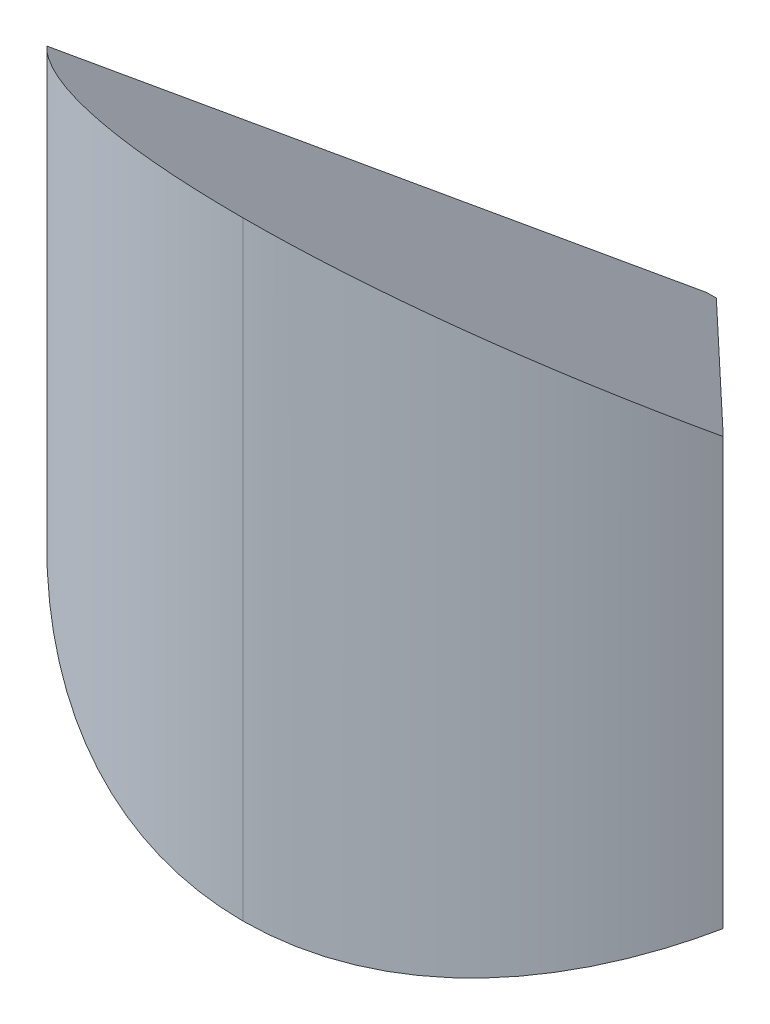
ISO-10303-21;
HEADER;
FILE_DESCRIPTION(('STEP AP214'),'2;1');
FILE_NAME('part.step','',(''),(''),'','','');
FILE_SCHEMA(('AUTOMOTIVE_DESIGN { 1 0 10303 214 1 1 1 1 }'));
ENDSEC;
DATA;
#1=APPLICATION_CONTEXT('core data for automotive mechanical design processes');
#2=APPLICATION_PROTOCOL_DEFINITION('international standard','automotive_design',2000,#1);
#3=PRODUCT_CONTEXT('',#1,'mechanical');
#4=PRODUCT('Part','Part','',(#3));
#5=PRODUCT_RELATED_PRODUCT_CATEGORY('part','',(#4));
#6=PRODUCT_DEFINITION_FORMATION('','',#4);
#7=PRODUCT_DEFINITION_CONTEXT('part definition',#1,'design');
#8=PRODUCT_DEFINITION('design','',#6,#7);
#9=PRODUCT_DEFINITION_SHAPE('','',#8);
#10=(LENGTH_UNIT() NAMED_UNIT(*) SI_UNIT(.MILLI.,.METRE.));
#11=(NAMED_UNIT(*) PLANE_ANGLE_UNIT() SI_UNIT($,.RADIAN.));
#12=(NAMED_UNIT(*) SI_UNIT($,.STERADIAN.) SOLID_ANGLE_UNIT());
#13=UNCERTAINTY_MEASURE_WITH_UNIT(LENGTH_MEASURE(1.E-05),#10,'distance_accuracy_value','');
#14=(GEOMETRIC_REPRESENTATION_CONTEXT(3) GLOBAL_UNCERTAINTY_ASSIGNED_CONTEXT((#13)) GLOBAL_UNIT_ASSIGNED_CONTEXT((#10,
#11,#12)) REPRESENTATION_CONTEXT('',''));
#15=CARTESIAN_POINT('',(0.,0.,0.));
#16=DIRECTION('',(0.,0.,1.));
#17=DIRECTION('',(1.,0.,0.));
#18=AXIS2_PLACEMENT_3D('',#15,#16,#17);
#19=CARTESIAN_POINT('',(4.000332533264,0.,1.681584956466));
#20=DIRECTION('',(-0.699663340513385,0.,-0.714472679632785));
#21=DIRECTION('',(-0.714472679632785,0.,0.699663340513385));
#22=AXIS2_PLACEMENT_3D('',#19,#20,#21);
#23=PLANE('',#22);
#24=DIRECTION('',(0.,1.,0.));
#25=VECTOR('',#24,1.);
#26=CARTESIAN_POINT('',(-14.28945359266,-9.000771663037,19.59226681027));
#27=LINE('',#26,#25);
#28=CARTESIAN_POINT('',(-14.28945359266,-9.000771663036,19.59226681027));
#29=VERTEX_POINT('',#28);
#30=CARTESIAN_POINT('',(-14.28945359266,9.000771663034,19.59226681027));
#31=VERTEX_POINT('',#30);
#32=EDGE_CURVE('E141',#29,#31,#27,.T.);
#33=ORIENTED_EDGE('',*,*,#32,.T.);
#34=DIRECTION('',(-0.651533593847997,0.410393936408799,0.638028834024297));
#35=VECTOR('',#34,1.);
#36=CARTESIAN_POINT('',(-0.2042332757092,0.1286443228024,5.799));
#37=LINE('',#36,#35);
#38=CARTESIAN_POINT('',(-0.2042332757092,0.1286443228024,5.799));
#39=VERTEX_POINT('',#38);
#40=EDGE_CURVE('E11',#39,#31,#37,.T.);
#41=ORIENTED_EDGE('',*,*,#40,.F.);
#42=DIRECTION('',(-1.546527368463E-12,1.,1.222032786687E-12));
#43=VECTOR('',#42,1.);
#44=CARTESIAN_POINT('',(-0.2042332757088,-0.1286443228045,5.799));
#45=LINE('',#44,#43);
#46=CARTESIAN_POINT('',(-0.2042332757088,-0.1286443228045,5.799));
#47=VERTEX_POINT('',#46);
#48=EDGE_CURVE('E46',#47,#39,#45,.T.);
#49=ORIENTED_EDGE('',*,*,#48,.F.);
#50=DIRECTION('',(0.651533593847997,0.410393936408799,-0.638028834024297));
#51=VECTOR('',#50,1.);
#52=CARTESIAN_POINT('',(-14.28945359266,-9.000771663037,19.59226681027));
#53=LINE('',#52,#51);
#54=EDGE_CURVE('E87',#29,#47,#53,.T.);
#55=ORIENTED_EDGE('',*,*,#54,.F.);
#56=EDGE_LOOP('',(#33,#41,#49,#55));
#57=FACE_BOUND('',#56,.T.);
#58=ADVANCED_FACE('F17',(#57),#23,.T.);
#59=CARTESIAN_POINT('',(-14.28945359266,0.1286443228029,5.799));
#60=DIRECTION('',(0.,-0.841039012964392,0.540974471367995));
#61=DIRECTION('',(-1.,0.,0.));
#62=AXIS2_PLACEMENT_3D('',#59,#60,#61);
#63=PLANE('',#62);
#64=DIRECTION('',(0.651533593847997,0.410393936408799,0.638028834024297));
#65=VECTOR('',#64,1.);
#66=CARTESIAN_POINT('',(0.2042332757092,0.1286443228024,5.799));
#67=LINE('',#66,#65);
#68=CARTESIAN_POINT('',(0.2042332757092,0.1286443228024,5.799));
#69=VERTEX_POINT('',#68);
#70=CARTESIAN_POINT('',(14.28945359266,9.000771663034,19.59226681027));
#71=VERTEX_POINT('',#70);
#72=EDGE_CURVE('E98',#69,#71,#67,.T.);
#73=ORIENTED_EDGE('',*,*,#72,.F.);
#74=DIRECTION('',(1.,0.,0.));
#75=VECTOR('',#74,1.);
#76=CARTESIAN_POINT('',(-0.2042332757092,0.1286443228024,5.799));
#77=LINE('',#76,#75);
#78=EDGE_CURVE('E28',#39,#69,#77,.T.);
#79=ORIENTED_EDGE('',*,*,#78,.F.);
#80=ORIENTED_EDGE('',*,*,#40,.T.);
#81=CARTESIAN_POINT('',(0.,12.86443228029,25.599));
#82=CARTESIAN_POINT('',(-0.334926275390209,12.8644397950071,25.5990199729841));
#83=CARTESIAN_POINT('',(-0.66984371311759,12.8589423454734,25.5905876807877));
#84=CARTESIAN_POINT('',(-1.34002546628665,12.8370597656007,25.5568857359147));
#85=CARTESIAN_POINT('',(-1.67528425954222,12.8206245456806,25.531538620242));
#86=CARTESIAN_POINT('',(-2.34528439253453,12.7768686704422,25.4638863211853));
#87=CARTESIAN_POINT('',(-2.68001217854618,12.7494872166826,25.4214864137275));
#88=CARTESIAN_POINT('',(-3.34808183652063,12.6838517491839,25.3196809773961));
#89=CARTESIAN_POINT('',(-3.68139985536102,12.6455269425867,25.2601647036633));
#90=CARTESIAN_POINT('',(-4.34577008420802,12.5580137801531,25.1241154132113));
#91=CARTESIAN_POINT('',(-4.6767860312731,12.5087453693679,25.0474569682556));
#92=CARTESIAN_POINT('',(-5.33566609987719,12.399354626408,24.8771593384552));
#93=CARTESIAN_POINT('',(-5.66347970509569,12.3391438126345,24.7833816956824));
#94=CARTESIAN_POINT('',(-6.31506165080029,12.2078746128825,24.5789282962459));
#95=CARTESIAN_POINT('',(-6.63876362247683,12.1367201736046,24.4681029083021));
#96=CARTESIAN_POINT('',(-7.28123443666715,11.9835776011918,24.2296793028669));
#97=CARTESIAN_POINT('',(-7.59991985485228,11.9014868329152,24.101922253007));
#98=CARTESIAN_POINT('',(-8.20107294436106,11.7348688212569,23.8429073178971));
#99=CARTESIAN_POINT('',(-8.48430246699901,11.6511545778792,23.7128897329706));
#100=CARTESIAN_POINT('',(-9.04770863577996,11.4742681888201,23.4382550648111));
#101=CARTESIAN_POINT('',(-9.32772686275894,11.3809473996145,23.2934088135945));
#102=CARTESIAN_POINT('',(-9.8838654818281,11.184854970526,22.9889859484772));
#103=CARTESIAN_POINT('',(-10.1598087260763,11.0819366439398,22.8291804825384));
#104=CARTESIAN_POINT('',(-10.7069261688309,10.866644796674,22.4947541219221));
#105=CARTESIAN_POINT('',(-10.9779047294679,10.754126839652,22.3199063625249));
#106=CARTESIAN_POINT('',(-11.5141929056087,10.5196340688499,21.9553605027602));
#107=CARTESIAN_POINT('',(-11.7792886601395,10.397517544921,21.7654391697102));
#108=CARTESIAN_POINT('',(-12.3028875802071,10.1438240916073,21.3707641038678));
#109=CARTESIAN_POINT('',(-12.5611590820732,10.0121084830333,21.1657923514005));
#110=CARTESIAN_POINT('',(-13.0701590837824,9.73921585356151,20.7410918751206));
#111=CARTESIAN_POINT('',(-13.3206385174765,9.59790350338754,20.5211518973684));
#112=CARTESIAN_POINT('',(-13.8131011358215,9.30580600265339,20.0666459545953));
#113=CARTESIAN_POINT('',(-14.0548187503553,9.15488887085311,19.8318768951732));
#114=CARTESIAN_POINT('',(-14.2894535926567,9.000771663033,19.5922668102667));
#115=B_SPLINE_CURVE_WITH_KNOTS('',3,(#81,#82,#83,#84,#85,#86,#87,#88,#89,#90,#91,#92,#93,#94,
#95,#96,#97,#98,#99,#100,#101,#102,#103,#104,#105,#106,#107,#108,#109,#110,#111,#112,#113,#114),
.UNSPECIFIED.,.F.,.F.,(4,2,2,2,2,2,2,2,2,2,2,2,2,2,2,2,4),(0.,1.00461450227702,2.01386159423785,
3.02879399054723,4.05044683143639,5.0798349832321,6.11795062617798,7.16576114830514,
8.22420735538374,9.19186272572721,10.1777749286408,11.1825548953025,12.2067797916721,
13.2509945380426,14.315713359979,15.4014213464175,16.5085759951863),.UNSPECIFIED.);
#116=CARTESIAN_POINT('',(0.,12.86443228029,25.599));
#117=VERTEX_POINT('',#116);
#118=EDGE_CURVE('E144',#117,#31,#115,.T.);
#119=ORIENTED_EDGE('',*,*,#118,.F.);
#120=CARTESIAN_POINT('',(14.2894535926567,9.000771663033,19.5922668102667));
#121=CARTESIAN_POINT('',(14.0548238152947,9.15488554951796,19.8318717250117));
#122=CARTESIAN_POINT('',(13.8131115177347,9.30579933237182,20.066635873411));
#123=CARTESIAN_POINT('',(13.3206585099523,9.59789112856126,20.5211339353059));
#124=CARTESIAN_POINT('',(13.0701832818667,9.73920108277189,20.7410708732902));
#125=CARTESIAN_POINT('',(12.5611904224657,10.012089910954,21.1657669972454));
#126=CARTESIAN_POINT('',(12.3029217741092,10.1438040703853,21.3707373649256));
#127=CARTESIAN_POINT('',(11.7793270763435,10.3974956229181,21.7654111583264));
#128=CARTESIAN_POINT('',(11.5142326123433,10.5196116475131,21.9553325295241));
#129=CARTESIAN_POINT('',(10.977945342474,10.7541044146182,22.3198797188699));
#130=CARTESIAN_POINT('',(10.7069663243592,10.8666228157404,22.4947286939222));
#131=CARTESIAN_POINT('',(10.1598461365826,11.0819165722767,22.8291584812933));
#132=CARTESIAN_POINT('',(9.88390053661663,11.1848363079811,22.9889660814117));
#133=CARTESIAN_POINT('',(9.32775522477851,11.3809325009553,23.2933939543076));
#134=CARTESIAN_POINT('',(9.04773259820651,11.4742555862192,23.4382430012674));
#135=CARTESIAN_POINT('',(8.48431561177478,11.6511478058149,23.7128837013557));
#136=CARTESIAN_POINT('',(8.201079612757,11.7348655153927,23.8429044447735));
#137=CARTESIAN_POINT('',(7.59992580516421,11.9014867780228,24.1019196891855));
#138=CARTESIAN_POINT('',(7.28124649891174,11.9835777172019,24.229674470928));
#139=CARTESIAN_POINT('',(6.63878634098475,12.1367204305741,24.4680948293851));
#140=CARTESIAN_POINT('',(6.31508887319114,12.2078747965441,24.5789191555788));
#141=CARTESIAN_POINT('',(5.66351430825551,12.3391439614326,24.7833714311036));
#142=CARTESIAN_POINT('',(5.3357035435872,12.3993547638501,24.8771489265822));
#143=CARTESIAN_POINT('',(4.67682740552603,12.5087455176416,25.0474470021674));
#144=CARTESIAN_POINT('',(4.34581251756163,12.5580138984281,25.1241059527504));
#145=CARTESIAN_POINT('',(3.68144258524746,12.6455270589431,25.2601567185212));
#146=CARTESIAN_POINT('',(3.34812377854871,12.6838518384591,25.3196738726663));
#147=CARTESIAN_POINT('',(2.68005067355422,12.7494873069756,25.4214812561786));
#148=CARTESIAN_POINT('',(2.34532020909407,12.7768687313411,25.4638821397524));
#149=CARTESIAN_POINT('',(1.67531282939416,12.8206246062238,25.5315362968343));
#150=CARTESIAN_POINT('',(1.34004945484371,12.8370597957921,25.5568842028823));
#151=CARTESIAN_POINT('',(0.669856653647208,12.8589423765147,25.590587355848));
#152=CARTESIAN_POINT('',(0.334932742662512,12.8644397965951,25.5990199740848));
#153=CARTESIAN_POINT('',(0.,12.86443228029,25.599));
#154=B_SPLINE_CURVE_WITH_KNOTS('',3,(#120,#121,#122,#123,#124,#125,#126,#127,#128,#129,#130,
#131,#132,#133,#134,#135,#136,#137,#138,#139,#140,#141,#142,#143,#144,#145,#146,#147,#148,#149,
#150,#151,#152,#153),.UNSPECIFIED.,.F.,.F.,(4,2,2,2,2,2,2,2,2,2,2,2,2,2,2,2,4),(0.,
1.10713075936815,2.1928216886937,3.25753028497046,4.30174162735544,5.32596992125252,
6.33076005483179,7.31668914824793,8.28436807133701,9.34279540267026,10.3905923524076,
11.4286998044177,12.4580852123502,13.4797408082072,14.4946814949436,15.5039424331723,
16.5085763407715),.UNSPECIFIED.);
#155=EDGE_CURVE('E151',#71,#117,#154,.T.);
#156=ORIENTED_EDGE('',*,*,#155,.F.);
#157=EDGE_LOOP('',(#73,#79,#80,#119,#156));
#158=FACE_BOUND('',#157,.T.);
#159=ADVANCED_FACE('F19',(#158),#63,.F.);
#160=CARTESIAN_POINT('',(-14.28945359266,-0.1286443228029,5.799));
#161=DIRECTION('',(0.,0.,1.));
#162=DIRECTION('',(1.,0.,0.));
#163=AXIS2_PLACEMENT_3D('',#160,#161,#162);
#164=PLANE('',#163);
#165=DIRECTION('',(1.546527368463E-12,1.,1.218580716668E-12));
#166=VECTOR('',#165,1.);
#167=CARTESIAN_POINT('',(0.2042332757088,-0.1286443228045,5.799));
#168=LINE('',#167,#166);
#169=CARTESIAN_POINT('',(0.2042332757088,-0.1286443228045,5.799));
#170=VERTEX_POINT('',#169);
#171=EDGE_CURVE('E92',#170,#69,#168,.T.);
#172=ORIENTED_EDGE('',*,*,#171,.F.);
#173=DIRECTION('',(1.,0.,0.));
#174=VECTOR('',#173,1.);
#175=CARTESIAN_POINT('',(-0.2042332757088,-0.1286443228045,5.799));
#176=LINE('',#175,#174);
#177=EDGE_CURVE('E80',#47,#170,#176,.T.);
#178=ORIENTED_EDGE('',*,*,#177,.F.);
#179=ORIENTED_EDGE('',*,*,#48,.T.);
#180=ORIENTED_EDGE('',*,*,#78,.T.);
#181=EDGE_LOOP('',(#172,#178,#179,#180));
#182=FACE_BOUND('',#181,.T.);
#183=ADVANCED_FACE('F93',(#182),#164,.F.);
#184=CARTESIAN_POINT('',(-14.28945359266,-12.86443228029,25.599));
#185=DIRECTION('',(0.,0.841039012964392,0.540974471367995));
#186=DIRECTION('',(1.,0.,0.));
#187=AXIS2_PLACEMENT_3D('',#184,#185,#186);
#188=PLANE('',#187);
#189=ORIENTED_EDGE('',*,*,#54,.T.);
#190=ORIENTED_EDGE('',*,*,#177,.T.);
#191=DIRECTION('',(-0.651533593847997,0.410393936408799,-0.638028834024297));
#192=VECTOR('',#191,1.);
#193=CARTESIAN_POINT('',(14.28945359266,-9.000771663037,19.59226681027));
#194=LINE('',#193,#192);
#195=CARTESIAN_POINT('',(14.28945359266,-9.000771663037,19.59226681027));
#196=VERTEX_POINT('',#195);
#197=EDGE_CURVE('E85',#196,#170,#194,.T.);
#198=ORIENTED_EDGE('',*,*,#197,.F.);
#199=CARTESIAN_POINT('',(0.,-12.86443228029,25.599));
#200=CARTESIAN_POINT('',(0.334926275381373,-12.864439795007,25.5990199729841));
#201=CARTESIAN_POINT('',(0.669843713099825,-12.8589423454733,25.5905876807882));
#202=CARTESIAN_POINT('',(1.34002546625365,-12.8370597656006,25.5568857359168));
#203=CARTESIAN_POINT('',(1.6752842595029,-12.8206245456805,25.5315386202452));
#204=CARTESIAN_POINT('',(2.34528439248521,-12.7768686704422,25.463886321191));
#205=CARTESIAN_POINT('',(2.68001217849317,-12.7494872166825,25.4214864137346));
#206=CARTESIAN_POINT('',(3.34808183646286,-12.6838517491838,25.3196809774059));
#207=CARTESIAN_POINT('',(3.68139985530216,-12.6455269425865,25.2601647036743));
#208=CARTESIAN_POINT('',(4.34577008414957,-12.558013780153,25.1241154132244));
#209=CARTESIAN_POINT('',(4.6767860312161,-12.5087453693677,25.0474569682693));
#210=CARTESIAN_POINT('',(5.33566609982561,-12.3993546264078,24.8771593384696));
#211=CARTESIAN_POINT('',(5.66347970504805,-12.3391438126343,24.7833816956965));
#212=CARTESIAN_POINT('',(6.31506165076282,-12.2078746128823,24.5789282962585));
#213=CARTESIAN_POINT('',(6.63876362244556,-12.1367201736042,24.4681029083132));
#214=CARTESIAN_POINT('',(7.28123443665058,-11.9835776011916,24.2296793028735));
#215=CARTESIAN_POINT('',(7.59991985484414,-11.9014868329153,24.1019222530105));
#216=CARTESIAN_POINT('',(8.20107294435291,-11.7348688212612,23.8429073179006));
#217=CARTESIAN_POINT('',(8.48430246698288,-11.651154577888,23.712889732978));
#218=CARTESIAN_POINT('',(9.0477086357505,-11.4742681888365,23.438255064826));
#219=CARTESIAN_POINT('',(9.32772686272406,-11.380947399634,23.2934088136128));
#220=CARTESIAN_POINT('',(9.88386548178496,-11.1848549705504,22.9889859485017));
#221=CARTESIAN_POINT('',(10.1598087260303,-11.0819366439662,22.8291804825655));
#222=CARTESIAN_POINT('',(10.7069261687815,-10.8666447967031,22.4947541219534));
#223=CARTESIAN_POINT('',(10.9779047294179,-10.7541268396817,22.3199063625577));
#224=CARTESIAN_POINT('',(11.5141929055598,-10.5196340688799,21.9553605027947));
#225=CARTESIAN_POINT('',(11.7792886600922,-10.3975175449505,21.7654391697447));
#226=CARTESIAN_POINT('',(12.302887580165,-10.1438240916347,21.3707641039007));
#227=CARTESIAN_POINT('',(12.5611590820346,-10.0121084830589,21.1657923514317));
#228=CARTESIAN_POINT('',(13.0701590837526,-9.73921585358256,20.7410918751464));
#229=CARTESIAN_POINT('',(13.3206385174519,-9.59790350340569,20.5211518973905));
#230=CARTESIAN_POINT('',(13.8131011358088,-9.30580600266458,20.0666459546078));
#231=CARTESIAN_POINT('',(14.054818750349,-9.1548888708602,19.8318768951795));
#232=CARTESIAN_POINT('',(14.2894535926567,-9.000771663036,19.5922668102667));
#233=B_SPLINE_CURVE_WITH_KNOTS('',3,(#199,#200,#201,#202,#203,#204,#205,#206,#207,#208,#209,
#210,#211,#212,#213,#214,#215,#216,#217,#218,#219,#220,#221,#222,#223,#224,#225,#226,#227,#228,
#229,#230,#231,#232),.UNSPECIFIED.,.F.,.F.,(4,2,2,2,2,2,2,2,2,2,2,2,2,2,2,2,4),(0.,
1.00461450225025,2.01386159419199,3.02879399048993,4.05044683137529,5.07983498317476,
6.11795062613197,7.16576114827782,8.22420735538248,9.19186272569673,10.1777749285893,
11.1825548952383,12.2067797916036,13.2509945379782,14.3157133599271,15.4014213463865,
16.5085759951847),.UNSPECIFIED.);
#234=CARTESIAN_POINT('',(0.,-12.86443228029,25.599));
#235=VERTEX_POINT('',#234);
#236=EDGE_CURVE('E195',#235,#196,#233,.T.);
#237=ORIENTED_EDGE('',*,*,#236,.F.);
#238=CARTESIAN_POINT('',(-14.2894535926567,-9.000771663036,19.5922668102667));
#239=CARTESIAN_POINT('',(-14.0548238152927,-9.15488554952231,19.8318717250137));
#240=CARTESIAN_POINT('',(-13.8131115177305,-9.30579933237751,20.0666358734151));
#241=CARTESIAN_POINT('',(-13.3206585099442,-9.5978911285692,20.5211339353131));
#242=CARTESIAN_POINT('',(-13.0701832818569,-9.73920108278075,20.7410708732987));
#243=CARTESIAN_POINT('',(-12.561190422453,-10.0120899109642,21.1657669972556));
#244=CARTESIAN_POINT('',(-12.3029217740954,-10.1438040703961,21.3707373649364));
#245=CARTESIAN_POINT('',(-11.779327076328,-10.3974956229294,21.7654111583377));
#246=CARTESIAN_POINT('',(-11.5142326123272,-10.5196116475245,21.9553325295354));
#247=CARTESIAN_POINT('',(-10.9779453424576,-10.7541044146294,22.3198797188807));
#248=CARTESIAN_POINT('',(-10.706966324343,-10.8666228157513,22.4947286939325));
#249=CARTESIAN_POINT('',(-10.1598461365674,-11.0819165722865,22.8291584813022));
#250=CARTESIAN_POINT('',(-9.88390053660241,-11.1848363079902,22.9889660814197));
#251=CARTESIAN_POINT('',(-9.327755224767,-11.3809325009625,23.2933939543136));
#252=CARTESIAN_POINT('',(-9.04773259819677,-11.4742555862253,23.4382430012723));
#253=CARTESIAN_POINT('',(-8.48431561176941,-11.6511478058181,23.7128837013582));
#254=CARTESIAN_POINT('',(-8.20107961275423,-11.7348655153943,23.8429044447747));
#255=CARTESIAN_POINT('',(-7.59992580516084,-11.9014867780228,24.101919689187));
#256=CARTESIAN_POINT('',(-7.28124649890502,-11.9835777172018,24.2296744709307));
#257=CARTESIAN_POINT('',(-6.63878634097215,-12.136720430574,24.4680948293895));
#258=CARTESIAN_POINT('',(-6.31508887317605,-12.207874796544,24.5789191555839));
#259=CARTESIAN_POINT('',(-5.66351430823635,-12.3391439614325,24.7833714311093));
#260=CARTESIAN_POINT('',(-5.33570354356648,-12.3993547638501,24.877148926588));
#261=CARTESIAN_POINT('',(-4.67682740550315,-12.5087455176415,25.047447002173));
#262=CARTESIAN_POINT('',(-4.34581251753816,-12.5580138984281,25.1241059527556));
#263=CARTESIAN_POINT('',(-3.68144258522382,-12.645527058943,25.2601567185256));
#264=CARTESIAN_POINT('',(-3.3481237785255,-12.6838518384591,25.3196738726702));
#265=CARTESIAN_POINT('',(-2.68005067353291,-12.7494873069756,25.4214812561815));
#266=CARTESIAN_POINT('',(-2.34532020907424,-12.7768687313411,25.4638821397547));
#267=CARTESIAN_POINT('',(-1.67531282937833,-12.8206246062238,25.5315362968356));
#268=CARTESIAN_POINT('',(-1.3400494548304,-12.8370597957921,25.5568842028832));
#269=CARTESIAN_POINT('',(-0.669856653639993,-12.8589423765147,25.5905873558482));
#270=CARTESIAN_POINT('',(-0.334932742658865,-12.8644397965951,25.5990199740848));
#271=CARTESIAN_POINT('',(0.,-12.86443228029,25.599));
#272=B_SPLINE_CURVE_WITH_KNOTS('',3,(#238,#239,#240,#241,#242,#243,#244,#245,#246,#247,#248,
#249,#250,#251,#252,#253,#254,#255,#256,#257,#258,#259,#260,#261,#262,#263,#264,#265,#266,#267,
#268,#269,#270,#271),.UNSPECIFIED.,.F.,.F.,(4,2,2,2,2,2,2,2,2,2,2,2,2,2,2,2,4),(0.,
1.10713075937779,2.19282168871021,3.25753028499101,4.30174162737728,5.32596992127287,
6.33076005484788,7.31668914825702,8.2843680713364,9.34279540268006,10.3905923524249,
11.4286998044395,12.4580852123735,13.479740808229,14.4946814949608,15.5039424331819,
16.5085763407704),.UNSPECIFIED.);
#273=EDGE_CURVE('E138',#29,#235,#272,.T.);
#274=ORIENTED_EDGE('',*,*,#273,.F.);
#275=EDGE_LOOP('',(#189,#190,#198,#237,#274));
#276=FACE_BOUND('',#275,.T.);
#277=ADVANCED_FACE('F82',(#276),#188,.F.);
#278=CARTESIAN_POINT('',(0.,0.,5.599));
#279=DIRECTION('',(0.,1.,0.));
#280=DIRECTION('',(0.,0.,1.));
#281=AXIS2_PLACEMENT_3D('',#278,#279,#280);
#282=CYLINDRICAL_SURFACE('',#281,20.);
#283=DIRECTION('',(0.,1.,0.));
#284=VECTOR('',#283,1.);
#285=CARTESIAN_POINT('',(0.,-12.86443228029,25.599));
#286=LINE('',#285,#284);
#287=EDGE_CURVE('E147',#235,#117,#286,.T.);
#288=ORIENTED_EDGE('',*,*,#287,.T.);
#289=ORIENTED_EDGE('',*,*,#118,.T.);
#290=ORIENTED_EDGE('',*,*,#32,.F.);
#291=ORIENTED_EDGE('',*,*,#273,.T.);
#292=EDGE_LOOP('',(#288,#289,#290,#291));
#293=FACE_BOUND('',#292,.T.);
#294=ADVANCED_FACE('F122',(#293),#282,.T.);
#295=CARTESIAN_POINT('',(0.,0.,5.599));
#296=DIRECTION('',(0.,1.,0.));
#297=DIRECTION('',(0.,0.,1.));
#298=AXIS2_PLACEMENT_3D('',#295,#296,#297);
#299=CYLINDRICAL_SURFACE('',#298,20.);
#300=ORIENTED_EDGE('',*,*,#236,.T.);
#301=DIRECTION('',(0.,-1.,0.));
#302=VECTOR('',#301,1.);
#303=CARTESIAN_POINT('',(14.28945359266,9.000771663034,19.59226681027));
#304=LINE('',#303,#302);
#305=EDGE_CURVE('E103',#71,#196,#304,.T.);
#306=ORIENTED_EDGE('',*,*,#305,.F.);
#307=ORIENTED_EDGE('',*,*,#155,.T.);
#308=ORIENTED_EDGE('',*,*,#287,.F.);
#309=EDGE_LOOP('',(#300,#306,#307,#308));
#310=FACE_BOUND('',#309,.T.);
#311=ADVANCED_FACE('F170',(#310),#299,.T.);
#312=CARTESIAN_POINT('',(-4.000332533264,0.,1.681584956466));
#313=DIRECTION('',(-0.699663340513385,0.,0.714472679632785));
#314=DIRECTION('',(0.,1.,0.));
#315=AXIS2_PLACEMENT_3D('',#312,#313,#314);
#316=PLANE('',#315);
#317=ORIENTED_EDGE('',*,*,#197,.T.);
#318=ORIENTED_EDGE('',*,*,#171,.T.);
#319=ORIENTED_EDGE('',*,*,#72,.T.);
#320=ORIENTED_EDGE('',*,*,#305,.T.);
#321=EDGE_LOOP('',(#317,#318,#319,#320));
#322=FACE_BOUND('',#321,.T.);
#323=ADVANCED_FACE('F101',(#322),#316,.F.);
#324=CLOSED_SHELL('',(#58,#159,#183,#277,#294,#311,#323));
#325=MANIFOLD_SOLID_BREP('B1',#324);
#326=ADVANCED_BREP_SHAPE_REPRESENTATION('',(#18,#325),#14);
#327=SHAPE_DEFINITION_REPRESENTATION(#9,#326);
ENDSEC;
END-ISO-10303-21;
